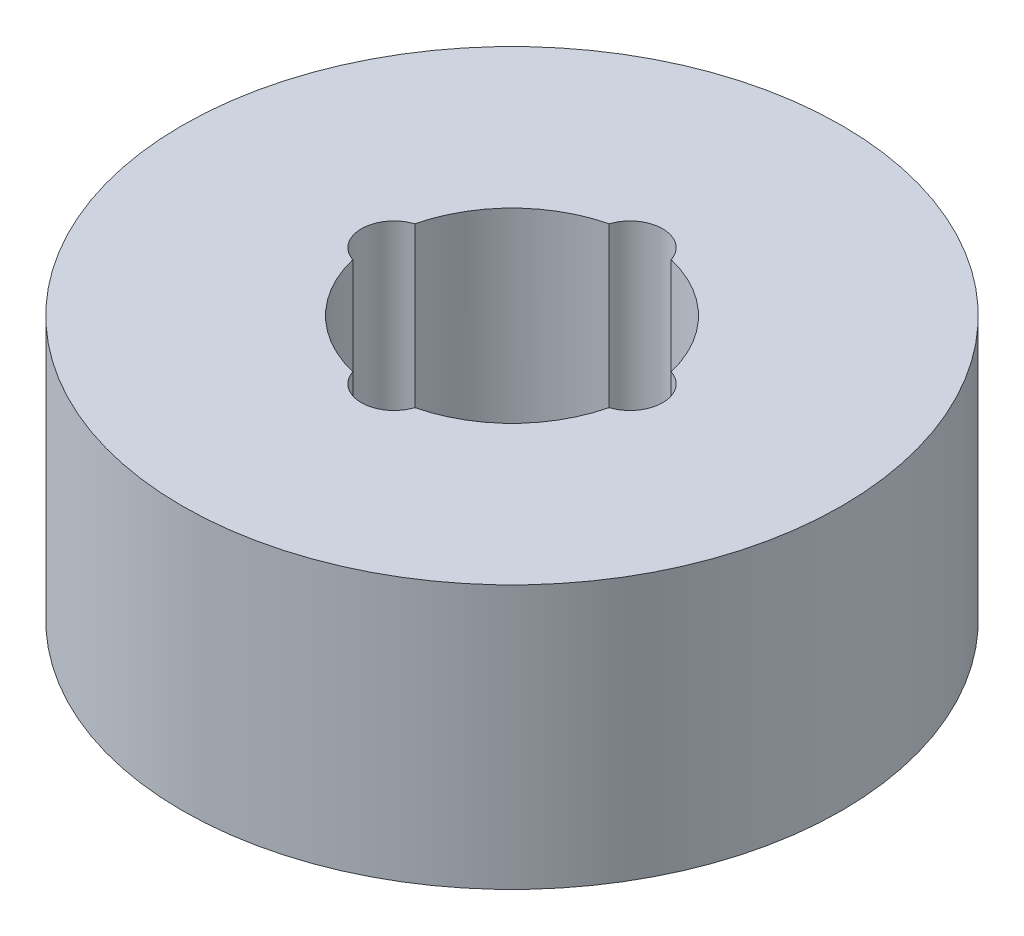
ISO-10303-21;
HEADER;
FILE_DESCRIPTION(('STEP AP214'),'2;1');
FILE_NAME('part.step','',(''),(''),'','','');
FILE_SCHEMA(('AUTOMOTIVE_DESIGN { 1 0 10303 214 1 1 1 1 }'));
ENDSEC;
DATA;
#1=APPLICATION_CONTEXT('core data for automotive mechanical design processes');
#2=APPLICATION_PROTOCOL_DEFINITION('international standard','automotive_design',2000,#1);
#3=PRODUCT_CONTEXT('',#1,'mechanical');
#4=PRODUCT('Part','Part','',(#3));
#5=PRODUCT_RELATED_PRODUCT_CATEGORY('part','',(#4));
#6=PRODUCT_DEFINITION_FORMATION('','',#4);
#7=PRODUCT_DEFINITION_CONTEXT('part definition',#1,'design');
#8=PRODUCT_DEFINITION('design','',#6,#7);
#9=PRODUCT_DEFINITION_SHAPE('','',#8);
#10=(LENGTH_UNIT() NAMED_UNIT(*) SI_UNIT(.MILLI.,.METRE.));
#11=(NAMED_UNIT(*) PLANE_ANGLE_UNIT() SI_UNIT($,.RADIAN.));
#12=(NAMED_UNIT(*) SI_UNIT($,.STERADIAN.) SOLID_ANGLE_UNIT());
#13=UNCERTAINTY_MEASURE_WITH_UNIT(LENGTH_MEASURE(1.E-05),#10,'distance_accuracy_value','');
#14=(GEOMETRIC_REPRESENTATION_CONTEXT(3) GLOBAL_UNCERTAINTY_ASSIGNED_CONTEXT((#13)) GLOBAL_UNIT_ASSIGNED_CONTEXT((#10,
#11,#12)) REPRESENTATION_CONTEXT('',''));
#15=CARTESIAN_POINT('',(0.,0.,0.));
#16=DIRECTION('',(0.,0.,1.));
#17=DIRECTION('',(1.,0.,0.));
#18=AXIS2_PLACEMENT_3D('',#15,#16,#17);
#19=CARTESIAN_POINT('',(0.,20.,0.));
#20=DIRECTION('',(0.,-1.,0.));
#21=DIRECTION('',(0.,0.,-1.));
#22=AXIS2_PLACEMENT_3D('',#19,#20,#21);
#23=CYLINDRICAL_SURFACE('',#22,25.);
#24=CARTESIAN_POINT('',(0.,20.,0.));
#25=DIRECTION('',(0.,1.,0.));
#26=DIRECTION('',(0.,0.,1.));
#27=AXIS2_PLACEMENT_3D('',#24,#25,#26);
#28=CIRCLE('',#27,25.);
#29=CARTESIAN_POINT('',(0.,20.,25.));
#30=VERTEX_POINT('',#29);
#31=EDGE_CURVE('E148',#30,#30,#28,.T.);
#32=ORIENTED_EDGE('',*,*,#31,.F.);
#33=EDGE_LOOP('',(#32));
#34=FACE_BOUND('',#33,.T.);
#35=CARTESIAN_POINT('',(0.,0.,0.));
#36=DIRECTION('',(0.,1.,0.));
#37=DIRECTION('',(0.,0.,1.));
#38=AXIS2_PLACEMENT_3D('',#35,#36,#37);
#39=CIRCLE('',#38,25.);
#40=CARTESIAN_POINT('',(0.,0.,25.));
#41=VERTEX_POINT('',#40);
#42=EDGE_CURVE('E139',#41,#41,#39,.T.);
#43=ORIENTED_EDGE('',*,*,#42,.T.);
#44=EDGE_LOOP('',(#43));
#45=FACE_BOUND('',#44,.T.);
#46=ADVANCED_FACE('F39',(#34,#45),#23,.T.);
#47=CARTESIAN_POINT('',(0.,20.,0.));
#48=DIRECTION('',(0.,1.,0.));
#49=DIRECTION('',(0.,0.,1.));
#50=AXIS2_PLACEMENT_3D('',#47,#48,#49);
#51=PLANE('',#50);
#52=CARTESIAN_POINT('',(0.,20.,8.94530363617778));
#53=DIRECTION('',(0.,1.,0.));
#54=DIRECTION('',(1.,0.,0.));
#55=AXIS2_PLACEMENT_3D('',#52,#53,#54);
#56=CIRCLE('',#55,2.47791930116115);
#57=CARTESIAN_POINT('',(-2.35404247391413,20.,9.71897546200258));
#58=VERTEX_POINT('',#57);
#59=CARTESIAN_POINT('',(2.3540424739142,20.,9.71897546200256));
#60=VERTEX_POINT('',#59);
#61=EDGE_CURVE('E175',#58,#60,#56,.T.);
#62=ORIENTED_EDGE('',*,*,#61,.F.);
#63=CARTESIAN_POINT('',(0.,20.,0.));
#64=DIRECTION('',(0.,1.,0.));
#65=DIRECTION('',(0.,0.,1.));
#66=AXIS2_PLACEMENT_3D('',#63,#64,#65);
#67=CIRCLE('',#66,10.);
#68=CARTESIAN_POINT('',(-9.71897546200257,20.,2.35404247391416));
#69=VERTEX_POINT('',#68);
#70=EDGE_CURVE('E134',#69,#58,#67,.T.);
#71=ORIENTED_EDGE('',*,*,#70,.F.);
#72=CARTESIAN_POINT('',(-8.94530363617778,20.,0.));
#73=DIRECTION('',(0.,1.,0.));
#74=DIRECTION('',(0.,0.,1.));
#75=AXIS2_PLACEMENT_3D('',#72,#73,#74);
#76=CIRCLE('',#75,2.47791930116115);
#77=CARTESIAN_POINT('',(-9.71897546200257,20.,-2.35404247391416));
#78=VERTEX_POINT('',#77);
#79=EDGE_CURVE('E143',#78,#69,#76,.T.);
#80=ORIENTED_EDGE('',*,*,#79,.F.);
#81=CARTESIAN_POINT('',(-2.35404247391427,20.,-9.71897546200255));
#82=VERTEX_POINT('',#81);
#83=EDGE_CURVE('E123',#82,#78,#67,.T.);
#84=ORIENTED_EDGE('',*,*,#83,.F.);
#85=CARTESIAN_POINT('',(0.,20.,-8.94530363617778));
#86=DIRECTION('',(0.,1.,0.));
#87=DIRECTION('',(-1.,0.,0.));
#88=AXIS2_PLACEMENT_3D('',#85,#86,#87);
#89=CIRCLE('',#88,2.47791930116115);
#90=CARTESIAN_POINT('',(2.35404247391406,20.,-9.71897546200259));
#91=VERTEX_POINT('',#90);
#92=EDGE_CURVE('E106',#91,#82,#89,.T.);
#93=ORIENTED_EDGE('',*,*,#92,.F.);
#94=CARTESIAN_POINT('',(9.71897546200257,20.,-2.35404247391416));
#95=VERTEX_POINT('',#94);
#96=EDGE_CURVE('E125',#95,#91,#67,.T.);
#97=ORIENTED_EDGE('',*,*,#96,.F.);
#98=CARTESIAN_POINT('',(8.94530363617778,20.,0.));
#99=DIRECTION('',(0.,1.,0.));
#100=DIRECTION('',(0.,0.,-1.));
#101=AXIS2_PLACEMENT_3D('',#98,#99,#100);
#102=CIRCLE('',#101,2.47791930116115);
#103=CARTESIAN_POINT('',(9.71897546200257,20.,2.35404247391416));
#104=VERTEX_POINT('',#103);
#105=EDGE_CURVE('E286',#104,#95,#102,.T.);
#106=ORIENTED_EDGE('',*,*,#105,.F.);
#107=EDGE_CURVE('E135',#60,#104,#67,.T.);
#108=ORIENTED_EDGE('',*,*,#107,.F.);
#109=EDGE_LOOP('',(#62,#71,#80,#84,#93,#97,#106,#108));
#110=FACE_BOUND('',#109,.T.);
#111=ORIENTED_EDGE('',*,*,#31,.T.);
#112=EDGE_LOOP('',(#111));
#113=FACE_BOUND('',#112,.T.);
#114=ADVANCED_FACE('F118',(#110,#113),#51,.T.);
#115=CARTESIAN_POINT('',(0.,0.,0.));
#116=DIRECTION('',(0.,1.,0.));
#117=DIRECTION('',(0.,0.,1.));
#118=AXIS2_PLACEMENT_3D('',#115,#116,#117);
#119=PLANE('',#118);
#120=CARTESIAN_POINT('',(0.,0.,0.));
#121=DIRECTION('',(0.,1.,0.));
#122=DIRECTION('',(0.,0.,1.));
#123=AXIS2_PLACEMENT_3D('',#120,#121,#122);
#124=CIRCLE('',#123,10.);
#125=CARTESIAN_POINT('',(0.,0.,10.));
#126=VERTEX_POINT('',#125);
#127=EDGE_CURVE('E136',#126,#126,#124,.T.);
#128=ORIENTED_EDGE('',*,*,#127,.T.);
#129=EDGE_LOOP('',(#128));
#130=FACE_BOUND('',#129,.T.);
#131=ORIENTED_EDGE('',*,*,#42,.F.);
#132=EDGE_LOOP('',(#131));
#133=FACE_BOUND('',#132,.T.);
#134=ADVANCED_FACE('F187',(#130,#133),#119,.F.);
#135=CARTESIAN_POINT('',(0.,20.,0.));
#136=DIRECTION('',(0.,-1.,0.));
#137=DIRECTION('',(0.,0.,-1.));
#138=AXIS2_PLACEMENT_3D('',#135,#136,#137);
#139=CYLINDRICAL_SURFACE('',#138,10.);
#140=DIRECTION('',(0.,1.,0.));
#141=VECTOR('',#140,1.);
#142=CARTESIAN_POINT('',(-2.35404247391413,10.9861427049138,9.71897546200258));
#143=LINE('',#142,#141);
#144=CARTESIAN_POINT('',(-2.35404247391413,1.97228540982754,9.71897546200258));
#145=VERTEX_POINT('',#144);
#146=EDGE_CURVE('E11',#145,#58,#143,.T.);
#147=ORIENTED_EDGE('',*,*,#146,.F.);
#148=CARTESIAN_POINT('',(0.,1.97228540982754,0.));
#149=DIRECTION('',(0.,1.,0.));
#150=DIRECTION('',(0.,0.,1.));
#151=AXIS2_PLACEMENT_3D('',#148,#149,#150);
#152=CIRCLE('',#151,10.);
#153=CARTESIAN_POINT('',(2.3540424739142,1.97228540982754,9.71897546200256));
#154=VERTEX_POINT('',#153);
#155=EDGE_CURVE('E170',#145,#154,#152,.T.);
#156=ORIENTED_EDGE('',*,*,#155,.T.);
#157=DIRECTION('',(0.,1.,0.));
#158=VECTOR('',#157,1.);
#159=CARTESIAN_POINT('',(2.3540424739142,10.9861427049138,9.71897546200256));
#160=LINE('',#159,#158);
#161=EDGE_CURVE('E46',#60,#154,#160,.F.);
#162=ORIENTED_EDGE('',*,*,#161,.F.);
#163=ORIENTED_EDGE('',*,*,#107,.T.);
#164=DIRECTION('',(0.,1.,0.));
#165=VECTOR('',#164,1.);
#166=CARTESIAN_POINT('',(9.71897546200257,10.9861427049138,2.35404247391416));
#167=LINE('',#166,#165);
#168=CARTESIAN_POINT('',(9.71897546200257,1.97228540982754,2.35404247391416));
#169=VERTEX_POINT('',#168);
#170=EDGE_CURVE('E164',#169,#104,#167,.T.);
#171=ORIENTED_EDGE('',*,*,#170,.F.);
#172=CARTESIAN_POINT('',(0.,1.97228540982754,0.));
#173=DIRECTION('',(0.,1.,0.));
#174=DIRECTION('',(0.,0.,1.));
#175=AXIS2_PLACEMENT_3D('',#172,#173,#174);
#176=CIRCLE('',#175,10.);
#177=CARTESIAN_POINT('',(9.71897546200257,1.97228540982754,-2.35404247391416));
#178=VERTEX_POINT('',#177);
#179=EDGE_CURVE('E115',#169,#178,#176,.T.);
#180=ORIENTED_EDGE('',*,*,#179,.T.);
#181=DIRECTION('',(0.,1.,0.));
#182=VECTOR('',#181,1.);
#183=CARTESIAN_POINT('',(9.71897546200257,10.9861427049138,-2.35404247391416));
#184=LINE('',#183,#182);
#185=EDGE_CURVE('E131',#95,#178,#184,.F.);
#186=ORIENTED_EDGE('',*,*,#185,.F.);
#187=ORIENTED_EDGE('',*,*,#96,.T.);
#188=DIRECTION('',(0.,1.,0.));
#189=VECTOR('',#188,1.);
#190=CARTESIAN_POINT('',(2.35404247391406,10.9861427049138,-9.71897546200259));
#191=LINE('',#190,#189);
#192=CARTESIAN_POINT('',(2.35404247391406,1.97228540982754,-9.71897546200259));
#193=VERTEX_POINT('',#192);
#194=EDGE_CURVE('E105',#193,#91,#191,.T.);
#195=ORIENTED_EDGE('',*,*,#194,.F.);
#196=CARTESIAN_POINT('',(0.,1.97228540982754,0.));
#197=DIRECTION('',(0.,1.,0.));
#198=DIRECTION('',(0.,0.,1.));
#199=AXIS2_PLACEMENT_3D('',#196,#197,#198);
#200=CIRCLE('',#199,10.);
#201=CARTESIAN_POINT('',(-2.35404247391427,1.97228540982754,-9.71897546200255));
#202=VERTEX_POINT('',#201);
#203=EDGE_CURVE('E159',#193,#202,#200,.T.);
#204=ORIENTED_EDGE('',*,*,#203,.T.);
#205=DIRECTION('',(0.,1.,0.));
#206=VECTOR('',#205,1.);
#207=CARTESIAN_POINT('',(-2.35404247391427,10.9861427049138,-9.71897546200255));
#208=LINE('',#207,#206);
#209=EDGE_CURVE('E114',#82,#202,#208,.F.);
#210=ORIENTED_EDGE('',*,*,#209,.F.);
#211=ORIENTED_EDGE('',*,*,#83,.T.);
#212=DIRECTION('',(0.,1.,0.));
#213=VECTOR('',#212,1.);
#214=CARTESIAN_POINT('',(-9.71897546200257,10.9861427049138,-2.35404247391416));
#215=LINE('',#214,#213);
#216=CARTESIAN_POINT('',(-9.71897546200257,1.97228540982754,-2.35404247391416));
#217=VERTEX_POINT('',#216);
#218=EDGE_CURVE('E160',#217,#78,#215,.T.);
#219=ORIENTED_EDGE('',*,*,#218,.F.);
#220=CARTESIAN_POINT('',(0.,1.97228540982754,0.));
#221=DIRECTION('',(0.,1.,0.));
#222=DIRECTION('',(0.,0.,1.));
#223=AXIS2_PLACEMENT_3D('',#220,#221,#222);
#224=CIRCLE('',#223,10.);
#225=CARTESIAN_POINT('',(-9.71897546200257,1.97228540982754,2.35404247391416));
#226=VERTEX_POINT('',#225);
#227=EDGE_CURVE('E149',#217,#226,#224,.T.);
#228=ORIENTED_EDGE('',*,*,#227,.T.);
#229=DIRECTION('',(0.,1.,0.));
#230=VECTOR('',#229,1.);
#231=CARTESIAN_POINT('',(-9.71897546200257,10.9861427049138,2.35404247391416));
#232=LINE('',#231,#230);
#233=EDGE_CURVE('E152',#69,#226,#232,.F.);
#234=ORIENTED_EDGE('',*,*,#233,.F.);
#235=ORIENTED_EDGE('',*,*,#70,.T.);
#236=EDGE_LOOP('',(#147,#156,#162,#163,#171,#180,#186,#187,#195,#204,#210,#211,#219,#228,#234,#235));
#237=FACE_BOUND('',#236,.T.);
#238=ORIENTED_EDGE('',*,*,#127,.F.);
#239=EDGE_LOOP('',(#238));
#240=FACE_BOUND('',#239,.T.);
#241=ADVANCED_FACE('F126',(#237,#240),#139,.F.);
#242=CARTESIAN_POINT('',(-8.94530363617778,1.97228540982754,0.));
#243=DIRECTION('',(0.,1.,0.));
#244=DIRECTION('',(0.,0.,1.));
#245=AXIS2_PLACEMENT_3D('',#242,#243,#244);
#246=CYLINDRICAL_SURFACE('',#245,2.47791930116115);
#247=ORIENTED_EDGE('',*,*,#218,.T.);
#248=ORIENTED_EDGE('',*,*,#79,.T.);
#249=ORIENTED_EDGE('',*,*,#233,.T.);
#250=CARTESIAN_POINT('',(-8.94530363617778,1.97228540982754,0.));
#251=DIRECTION('',(0.,1.,0.));
#252=DIRECTION('',(0.,0.,1.));
#253=AXIS2_PLACEMENT_3D('',#250,#251,#252);
#254=CIRCLE('',#253,2.47791930116115);
#255=EDGE_CURVE('E144',#217,#226,#254,.T.);
#256=ORIENTED_EDGE('',*,*,#255,.F.);
#257=EDGE_LOOP('',(#247,#248,#249,#256));
#258=FACE_BOUND('',#257,.T.);
#259=ADVANCED_FACE('F200',(#258),#246,.F.);
#260=CARTESIAN_POINT('',(-8.94530363617778,1.97228540982754,0.));
#261=DIRECTION('',(0.,1.,0.));
#262=DIRECTION('',(0.,0.,1.));
#263=AXIS2_PLACEMENT_3D('',#260,#261,#262);
#264=PLANE('',#263);
#265=ORIENTED_EDGE('',*,*,#255,.T.);
#266=ORIENTED_EDGE('',*,*,#227,.F.);
#267=EDGE_LOOP('',(#265,#266));
#268=FACE_BOUND('',#267,.T.);
#269=ADVANCED_FACE('F201',(#268),#264,.T.);
#270=CARTESIAN_POINT('',(0.,1.97228540982754,-8.94530363617778));
#271=DIRECTION('',(0.,1.,0.));
#272=DIRECTION('',(0.,0.,1.));
#273=AXIS2_PLACEMENT_3D('',#270,#271,#272);
#274=CYLINDRICAL_SURFACE('',#273,2.47791930116115);
#275=ORIENTED_EDGE('',*,*,#194,.T.);
#276=ORIENTED_EDGE('',*,*,#92,.T.);
#277=ORIENTED_EDGE('',*,*,#209,.T.);
#278=CARTESIAN_POINT('',(0.,1.97228540982754,-8.94530363617778));
#279=DIRECTION('',(0.,1.,0.));
#280=DIRECTION('',(-1.,0.,0.));
#281=AXIS2_PLACEMENT_3D('',#278,#279,#280);
#282=CIRCLE('',#281,2.47791930116115);
#283=EDGE_CURVE('E107',#193,#202,#282,.T.);
#284=ORIENTED_EDGE('',*,*,#283,.F.);
#285=EDGE_LOOP('',(#275,#276,#277,#284));
#286=FACE_BOUND('',#285,.T.);
#287=ADVANCED_FACE('F102',(#286),#274,.F.);
#288=CARTESIAN_POINT('',(0.,1.97228540982754,-8.94530363617778));
#289=DIRECTION('',(0.,1.,0.));
#290=DIRECTION('',(-1.,0.,0.));
#291=AXIS2_PLACEMENT_3D('',#288,#289,#290);
#292=PLANE('',#291);
#293=ORIENTED_EDGE('',*,*,#283,.T.);
#294=ORIENTED_EDGE('',*,*,#203,.F.);
#295=EDGE_LOOP('',(#293,#294));
#296=FACE_BOUND('',#295,.T.);
#297=ADVANCED_FACE('F209',(#296),#292,.T.);
#298=CARTESIAN_POINT('',(8.94530363617778,1.97228540982754,0.));
#299=DIRECTION('',(0.,1.,0.));
#300=DIRECTION('',(0.,0.,1.));
#301=AXIS2_PLACEMENT_3D('',#298,#299,#300);
#302=CYLINDRICAL_SURFACE('',#301,2.47791930116115);
#303=ORIENTED_EDGE('',*,*,#170,.T.);
#304=ORIENTED_EDGE('',*,*,#105,.T.);
#305=ORIENTED_EDGE('',*,*,#185,.T.);
#306=CARTESIAN_POINT('',(8.94530363617778,1.97228540982754,0.));
#307=DIRECTION('',(0.,1.,0.));
#308=DIRECTION('',(0.,0.,-1.));
#309=AXIS2_PLACEMENT_3D('',#306,#307,#308);
#310=CIRCLE('',#309,2.47791930116115);
#311=EDGE_CURVE('E56',#169,#178,#310,.T.);
#312=ORIENTED_EDGE('',*,*,#311,.F.);
#313=EDGE_LOOP('',(#303,#304,#305,#312));
#314=FACE_BOUND('',#313,.T.);
#315=ADVANCED_FACE('F213',(#314),#302,.F.);
#316=CARTESIAN_POINT('',(8.94530363617778,1.97228540982754,0.));
#317=DIRECTION('',(0.,1.,0.));
#318=DIRECTION('',(0.,0.,-1.));
#319=AXIS2_PLACEMENT_3D('',#316,#317,#318);
#320=PLANE('',#319);
#321=ORIENTED_EDGE('',*,*,#311,.T.);
#322=ORIENTED_EDGE('',*,*,#179,.F.);
#323=EDGE_LOOP('',(#321,#322));
#324=FACE_BOUND('',#323,.T.);
#325=ADVANCED_FACE('F179',(#324),#320,.T.);
#326=CARTESIAN_POINT('',(0.,1.97228540982754,8.94530363617778));
#327=DIRECTION('',(0.,1.,0.));
#328=DIRECTION('',(0.,0.,1.));
#329=AXIS2_PLACEMENT_3D('',#326,#327,#328);
#330=CYLINDRICAL_SURFACE('',#329,2.47791930116115);
#331=ORIENTED_EDGE('',*,*,#146,.T.);
#332=ORIENTED_EDGE('',*,*,#61,.T.);
#333=ORIENTED_EDGE('',*,*,#161,.T.);
#334=CARTESIAN_POINT('',(0.,1.97228540982754,8.94530363617778));
#335=DIRECTION('',(0.,1.,0.));
#336=DIRECTION('',(1.,0.,0.));
#337=AXIS2_PLACEMENT_3D('',#334,#335,#336);
#338=CIRCLE('',#337,2.47791930116115);
#339=EDGE_CURVE('E55',#145,#154,#338,.T.);
#340=ORIENTED_EDGE('',*,*,#339,.F.);
#341=EDGE_LOOP('',(#331,#332,#333,#340));
#342=FACE_BOUND('',#341,.T.);
#343=ADVANCED_FACE('F171',(#342),#330,.F.);
#344=CARTESIAN_POINT('',(0.,1.97228540982754,8.94530363617778));
#345=DIRECTION('',(0.,1.,0.));
#346=DIRECTION('',(1.,0.,0.));
#347=AXIS2_PLACEMENT_3D('',#344,#345,#346);
#348=PLANE('',#347);
#349=ORIENTED_EDGE('',*,*,#339,.T.);
#350=ORIENTED_EDGE('',*,*,#155,.F.);
#351=EDGE_LOOP('',(#349,#350));
#352=FACE_BOUND('',#351,.T.);
#353=ADVANCED_FACE('F173',(#352),#348,.T.);
#354=CLOSED_SHELL('',(#46,#114,#134,#241,#259,#269,#287,#297,#315,#325,#343,#353));
#355=MANIFOLD_SOLID_BREP('B2',#354);
#356=ADVANCED_BREP_SHAPE_REPRESENTATION('',(#18,#355),#14);
#357=SHAPE_DEFINITION_REPRESENTATION(#9,#356);
ENDSEC;
END-ISO-10303-21;
